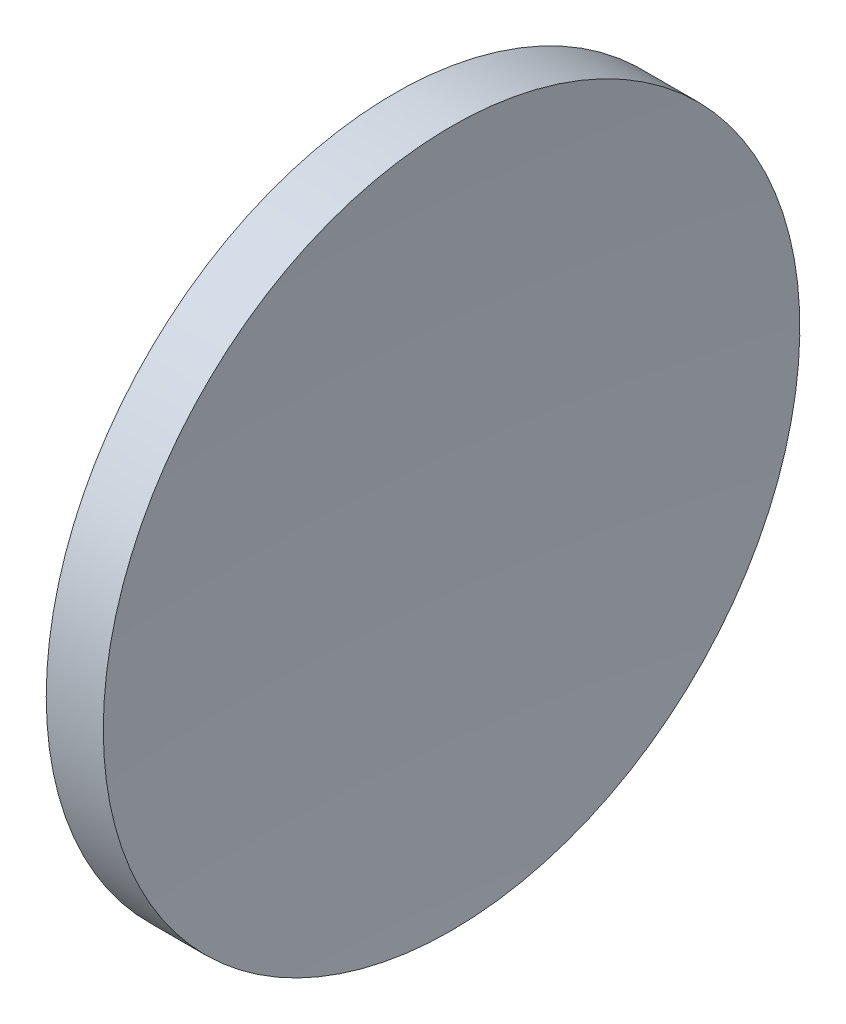
ISO-10303-21;
HEADER;
FILE_DESCRIPTION(('STEP AP214'),'2;1');
FILE_NAME('part.step','',(''),(''),'','','');
FILE_SCHEMA(('AUTOMOTIVE_DESIGN { 1 0 10303 214 1 1 1 1 }'));
ENDSEC;
DATA;
#1=APPLICATION_CONTEXT('core data for automotive mechanical design processes');
#2=APPLICATION_PROTOCOL_DEFINITION('international standard','automotive_design',2000,#1);
#3=PRODUCT_CONTEXT('',#1,'mechanical');
#4=PRODUCT('Part','Part','',(#3));
#5=PRODUCT_RELATED_PRODUCT_CATEGORY('part','',(#4));
#6=PRODUCT_DEFINITION_FORMATION('','',#4);
#7=PRODUCT_DEFINITION_CONTEXT('part definition',#1,'design');
#8=PRODUCT_DEFINITION('design','',#6,#7);
#9=PRODUCT_DEFINITION_SHAPE('','',#8);
#10=(LENGTH_UNIT() NAMED_UNIT(*) SI_UNIT(.MILLI.,.METRE.));
#11=(NAMED_UNIT(*) PLANE_ANGLE_UNIT() SI_UNIT($,.RADIAN.));
#12=(NAMED_UNIT(*) SI_UNIT($,.STERADIAN.) SOLID_ANGLE_UNIT());
#13=UNCERTAINTY_MEASURE_WITH_UNIT(LENGTH_MEASURE(1.E-05),#10,'distance_accuracy_value','');
#14=(GEOMETRIC_REPRESENTATION_CONTEXT(3) GLOBAL_UNCERTAINTY_ASSIGNED_CONTEXT((#13)) GLOBAL_UNIT_ASSIGNED_CONTEXT((#10,
#11,#12)) REPRESENTATION_CONTEXT('',''));
#15=CARTESIAN_POINT('',(0.,0.,0.));
#16=DIRECTION('',(0.,0.,1.));
#17=DIRECTION('',(1.,0.,0.));
#18=AXIS2_PLACEMENT_3D('',#15,#16,#17);
#19=CARTESIAN_POINT('',(374.59193167416,65.1556304570152,0.));
#20=DIRECTION('',(-1.,0.,0.));
#21=DIRECTION('',(0.,-1.,0.));
#22=AXIS2_PLACEMENT_3D('',#19,#20,#21);
#23=SPHERICAL_SURFACE('',#22,258.18);
#24=CARTESIAN_POINT('',(117.187750666935,65.1556304570152,0.));
#25=DIRECTION('',(-1.,0.,0.));
#26=DIRECTION('',(0.,0.,1.));
#27=AXIS2_PLACEMENT_3D('',#24,#25,#26);
#28=CIRCLE('',#27,20.);
#29=CARTESIAN_POINT('',(117.187750666935,65.1556304570152,20.));
#30=VERTEX_POINT('',#29);
#31=EDGE_CURVE('E10',#30,#30,#28,.T.);
#32=ORIENTED_EDGE('',*,*,#31,.F.);
#33=EDGE_LOOP('',(#32));
#34=FACE_BOUND('',#33,.T.);
#35=ADVANCED_FACE('F35',(#34),#23,.F.);
#36=CARTESIAN_POINT('',(105.62183712383,65.1556304570152,0.));
#37=DIRECTION('',(-1.,0.,0.));
#38=DIRECTION('',(0.,0.,1.));
#39=AXIS2_PLACEMENT_3D('',#36,#37,#38);
#40=CYLINDRICAL_SURFACE('',#39,20.);
#41=CARTESIAN_POINT('',(113.91193167416,65.1556304570152,0.));
#42=DIRECTION('',(-1.,0.,0.));
#43=DIRECTION('',(0.,0.,1.));
#44=AXIS2_PLACEMENT_3D('',#41,#42,#43);
#45=CIRCLE('',#44,20.);
#46=CARTESIAN_POINT('',(113.91193167416,65.1556304570152,20.));
#47=VERTEX_POINT('',#46);
#48=EDGE_CURVE('E41',#47,#47,#45,.T.);
#49=ORIENTED_EDGE('',*,*,#48,.F.);
#50=EDGE_LOOP('',(#49));
#51=FACE_BOUND('',#50,.T.);
#52=ORIENTED_EDGE('',*,*,#31,.T.);
#53=EDGE_LOOP('',(#52));
#54=FACE_BOUND('',#53,.T.);
#55=ADVANCED_FACE('F49',(#51,#54),#40,.T.);
#56=CARTESIAN_POINT('',(113.91193167416,65.1556304570152,0.));
#57=DIRECTION('',(1.,0.,0.));
#58=DIRECTION('',(0.,0.,-1.));
#59=AXIS2_PLACEMENT_3D('',#56,#57,#58);
#60=PLANE('',#59);
#61=ORIENTED_EDGE('',*,*,#48,.T.);
#62=EDGE_LOOP('',(#61));
#63=FACE_BOUND('',#62,.T.);
#64=ADVANCED_FACE('F47',(#63),#60,.F.);
#65=CLOSED_SHELL('',(#35,#55,#64));
#66=MANIFOLD_SOLID_BREP('B2',#65);
#67=ADVANCED_BREP_SHAPE_REPRESENTATION('',(#18,#66),#14);
#68=SHAPE_DEFINITION_REPRESENTATION(#9,#67);
ENDSEC;
END-ISO-10303-21;
